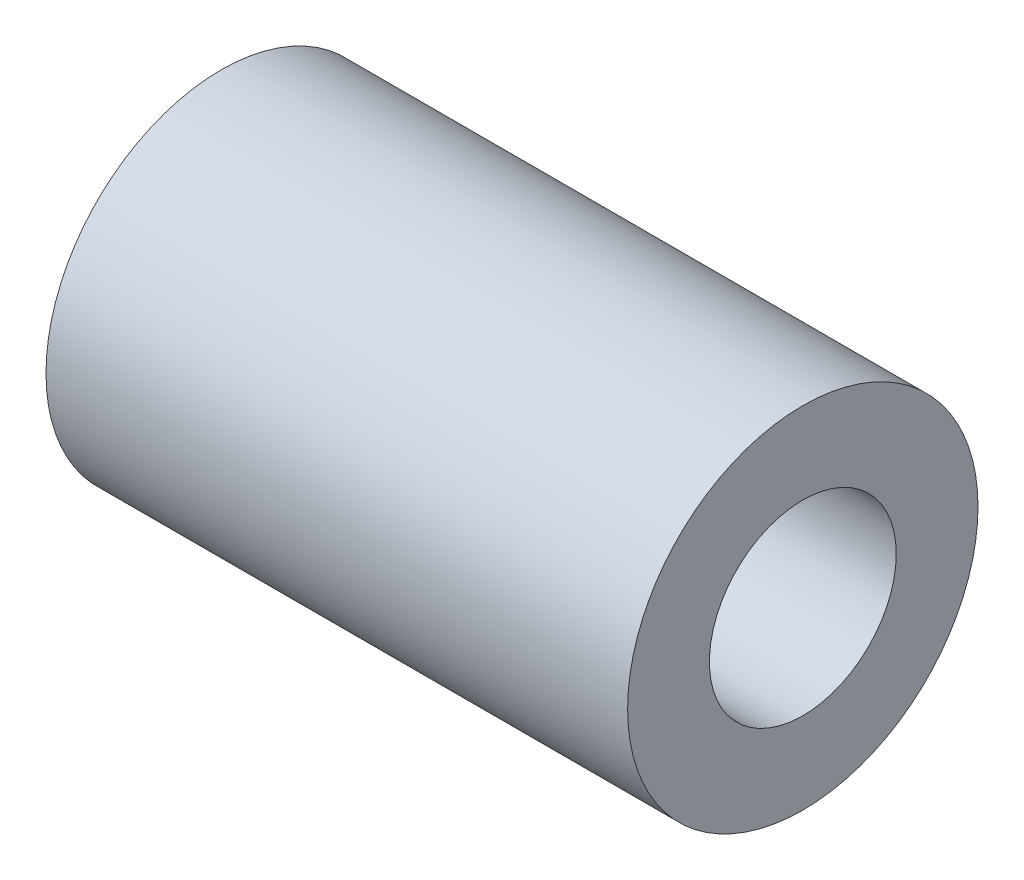
ISO-10303-21;
HEADER;
FILE_DESCRIPTION(('STEP AP214'),'2;1');
FILE_NAME('part.step','',(''),(''),'','','');
FILE_SCHEMA(('AUTOMOTIVE_DESIGN { 1 0 10303 214 1 1 1 1 }'));
ENDSEC;
DATA;
#1=APPLICATION_CONTEXT('core data for automotive mechanical design processes');
#2=APPLICATION_PROTOCOL_DEFINITION('international standard','automotive_design',2000,#1);
#3=PRODUCT_CONTEXT('',#1,'mechanical');
#4=PRODUCT('Part','Part','',(#3));
#5=PRODUCT_RELATED_PRODUCT_CATEGORY('part','',(#4));
#6=PRODUCT_DEFINITION_FORMATION('','',#4);
#7=PRODUCT_DEFINITION_CONTEXT('part definition',#1,'design');
#8=PRODUCT_DEFINITION('design','',#6,#7);
#9=PRODUCT_DEFINITION_SHAPE('','',#8);
#10=(LENGTH_UNIT() NAMED_UNIT(*) SI_UNIT(.MILLI.,.METRE.));
#11=(NAMED_UNIT(*) PLANE_ANGLE_UNIT() SI_UNIT($,.RADIAN.));
#12=(NAMED_UNIT(*) SI_UNIT($,.STERADIAN.) SOLID_ANGLE_UNIT());
#13=UNCERTAINTY_MEASURE_WITH_UNIT(LENGTH_MEASURE(1.E-05),#10,'distance_accuracy_value','');
#14=(GEOMETRIC_REPRESENTATION_CONTEXT(3) GLOBAL_UNCERTAINTY_ASSIGNED_CONTEXT((#13)) GLOBAL_UNIT_ASSIGNED_CONTEXT((#10,
#11,#12)) REPRESENTATION_CONTEXT('',''));
#15=CARTESIAN_POINT('',(0.,0.,0.));
#16=DIRECTION('',(0.,0.,1.));
#17=DIRECTION('',(1.,0.,0.));
#18=AXIS2_PLACEMENT_3D('',#15,#16,#17);
#19=CARTESIAN_POINT('',(24.9,0.,0.));
#20=DIRECTION('',(1.,0.,0.));
#21=DIRECTION('',(0.,0.,-1.));
#22=AXIS2_PLACEMENT_3D('',#19,#20,#21);
#23=PLANE('',#22);
#24=CARTESIAN_POINT('',(24.9,0.,0.));
#25=DIRECTION('',(1.,0.,0.));
#26=DIRECTION('',(0.,0.,-1.));
#27=AXIS2_PLACEMENT_3D('',#24,#25,#26);
#28=CIRCLE('',#27,7.5);
#29=CARTESIAN_POINT('',(24.9,0.,-7.5));
#30=VERTEX_POINT('',#29);
#31=EDGE_CURVE('E10',#30,#30,#28,.T.);
#32=ORIENTED_EDGE('',*,*,#31,.T.);
#33=EDGE_LOOP('',(#32));
#34=FACE_BOUND('',#33,.T.);
#35=CARTESIAN_POINT('',(24.9,0.,0.));
#36=DIRECTION('',(1.,0.,0.));
#37=DIRECTION('',(0.,0.,-1.));
#38=AXIS2_PLACEMENT_3D('',#35,#36,#37);
#39=CIRCLE('',#38,4.);
#40=CARTESIAN_POINT('',(24.9,0.,-4.));
#41=VERTEX_POINT('',#40);
#42=EDGE_CURVE('E42',#41,#41,#39,.T.);
#43=ORIENTED_EDGE('',*,*,#42,.F.);
#44=EDGE_LOOP('',(#43));
#45=FACE_BOUND('',#44,.T.);
#46=ADVANCED_FACE('F31',(#34,#45),#23,.T.);
#47=CARTESIAN_POINT('',(0.,0.,0.));
#48=DIRECTION('',(1.,0.,0.));
#49=DIRECTION('',(0.,0.,-1.));
#50=AXIS2_PLACEMENT_3D('',#47,#48,#49);
#51=PLANE('',#50);
#52=CARTESIAN_POINT('',(0.,0.,0.));
#53=DIRECTION('',(1.,0.,0.));
#54=DIRECTION('',(0.,0.,-1.));
#55=AXIS2_PLACEMENT_3D('',#52,#53,#54);
#56=CIRCLE('',#55,7.5);
#57=CARTESIAN_POINT('',(0.,0.,-7.5));
#58=VERTEX_POINT('',#57);
#59=EDGE_CURVE('E35',#58,#58,#56,.T.);
#60=ORIENTED_EDGE('',*,*,#59,.F.);
#61=EDGE_LOOP('',(#60));
#62=FACE_BOUND('',#61,.T.);
#63=CARTESIAN_POINT('',(0.,0.,0.));
#64=DIRECTION('',(1.,0.,0.));
#65=DIRECTION('',(0.,0.,-1.));
#66=AXIS2_PLACEMENT_3D('',#63,#64,#65);
#67=CIRCLE('',#66,4.);
#68=CARTESIAN_POINT('',(0.,0.,-4.));
#69=VERTEX_POINT('',#68);
#70=EDGE_CURVE('E44',#69,#69,#67,.T.);
#71=ORIENTED_EDGE('',*,*,#70,.T.);
#72=EDGE_LOOP('',(#71));
#73=FACE_BOUND('',#72,.T.);
#74=ADVANCED_FACE('F54',(#62,#73),#51,.F.);
#75=CARTESIAN_POINT('',(24.9,0.,0.));
#76=DIRECTION('',(-1.,0.,0.));
#77=DIRECTION('',(0.,0.,1.));
#78=AXIS2_PLACEMENT_3D('',#75,#76,#77);
#79=CYLINDRICAL_SURFACE('',#78,7.5);
#80=ORIENTED_EDGE('',*,*,#31,.F.);
#81=EDGE_LOOP('',(#80));
#82=FACE_BOUND('',#81,.T.);
#83=ORIENTED_EDGE('',*,*,#59,.T.);
#84=EDGE_LOOP('',(#83));
#85=FACE_BOUND('',#84,.T.);
#86=ADVANCED_FACE('F33',(#82,#85),#79,.T.);
#87=CARTESIAN_POINT('',(24.9,0.,0.));
#88=DIRECTION('',(-1.,0.,0.));
#89=DIRECTION('',(0.,0.,1.));
#90=AXIS2_PLACEMENT_3D('',#87,#88,#89);
#91=CYLINDRICAL_SURFACE('',#90,4.);
#92=ORIENTED_EDGE('',*,*,#42,.T.);
#93=EDGE_LOOP('',(#92));
#94=FACE_BOUND('',#93,.T.);
#95=ORIENTED_EDGE('',*,*,#70,.F.);
#96=EDGE_LOOP('',(#95));
#97=FACE_BOUND('',#96,.T.);
#98=ADVANCED_FACE('F50',(#94,#97),#91,.F.);
#99=CLOSED_SHELL('',(#46,#74,#86,#98));
#100=MANIFOLD_SOLID_BREP('B2',#99);
#101=ADVANCED_BREP_SHAPE_REPRESENTATION('',(#18,#100),#14);
#102=SHAPE_DEFINITION_REPRESENTATION(#9,#101);
ENDSEC;
END-ISO-10303-21;
